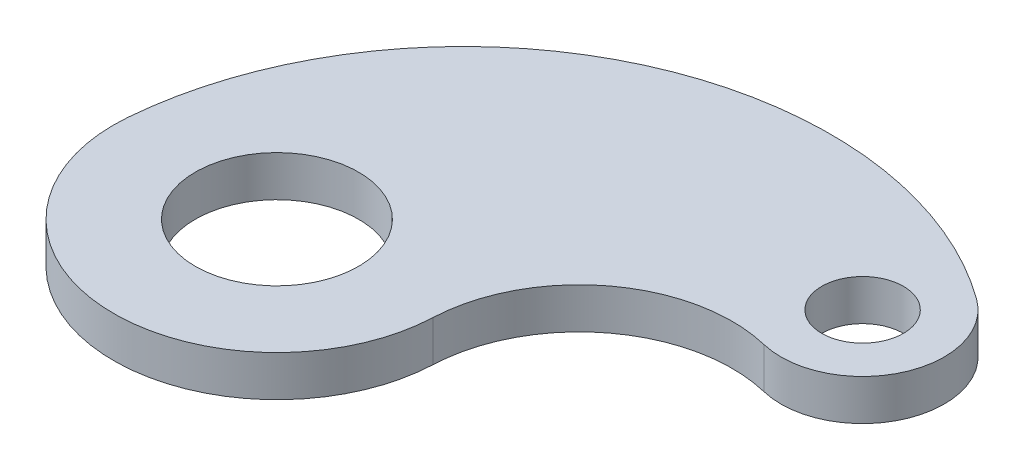
ISO-10303-21;
HEADER;
FILE_DESCRIPTION(('STEP AP214'),'2;1');
FILE_NAME('part.step','',(''),(''),'','','');
FILE_SCHEMA(('AUTOMOTIVE_DESIGN { 1 0 10303 214 1 1 1 1 }'));
ENDSEC;
DATA;
#1=APPLICATION_CONTEXT('core data for automotive mechanical design processes');
#2=APPLICATION_PROTOCOL_DEFINITION('international standard','automotive_design',2000,#1);
#3=PRODUCT_CONTEXT('',#1,'mechanical');
#4=PRODUCT('Part','Part','',(#3));
#5=PRODUCT_RELATED_PRODUCT_CATEGORY('part','',(#4));
#6=PRODUCT_DEFINITION_FORMATION('','',#4);
#7=PRODUCT_DEFINITION_CONTEXT('part definition',#1,'design');
#8=PRODUCT_DEFINITION('design','',#6,#7);
#9=PRODUCT_DEFINITION_SHAPE('','',#8);
#10=(LENGTH_UNIT() NAMED_UNIT(*) SI_UNIT(.MILLI.,.METRE.));
#11=(NAMED_UNIT(*) PLANE_ANGLE_UNIT() SI_UNIT($,.RADIAN.));
#12=(NAMED_UNIT(*) SI_UNIT($,.STERADIAN.) SOLID_ANGLE_UNIT());
#13=UNCERTAINTY_MEASURE_WITH_UNIT(LENGTH_MEASURE(1.E-05),#10,'distance_accuracy_value','');
#14=(GEOMETRIC_REPRESENTATION_CONTEXT(3) GLOBAL_UNCERTAINTY_ASSIGNED_CONTEXT((#13)) GLOBAL_UNIT_ASSIGNED_CONTEXT((#10,
#11,#12)) REPRESENTATION_CONTEXT('',''));
#15=CARTESIAN_POINT('',(0.,0.,0.));
#16=DIRECTION('',(0.,0.,1.));
#17=DIRECTION('',(1.,0.,0.));
#18=AXIS2_PLACEMENT_3D('',#15,#16,#17);
#19=CARTESIAN_POINT('',(154.851548457861,-10.,6.78217813115695));
#20=DIRECTION('',(0.,1.,0.));
#21=DIRECTION('',(0.,0.,1.));
#22=AXIS2_PLACEMENT_3D('',#19,#20,#21);
#23=CYLINDRICAL_SURFACE('',#22,75.);
#24=DIRECTION('',(0.,1.,0.));
#25=VECTOR('',#24,1.);
#26=CARTESIAN_POINT('',(172.469235199298,-10.,-66.1192423891634));
#27=LINE('',#26,#25);
#28=CARTESIAN_POINT('',(172.469235199298,-10.,-66.1192423891634));
#29=VERTEX_POINT('',#28);
#30=CARTESIAN_POINT('',(172.469235199298,10.,-66.1192423891634));
#31=VERTEX_POINT('',#30);
#32=EDGE_CURVE('E48',#29,#31,#27,.T.);
#33=ORIENTED_EDGE('',*,*,#32,.T.);
#34=CARTESIAN_POINT('',(154.851548457861,10.,6.78217813115695));
#35=DIRECTION('',(0.,-1.,0.));
#36=DIRECTION('',(0.,0.,-1.));
#37=AXIS2_PLACEMENT_3D('',#34,#35,#36);
#38=CIRCLE('',#37,75.);
#39=CARTESIAN_POINT('',(79.9233798492185,10.,3.5004790354358));
#40=VERTEX_POINT('',#39);
#41=EDGE_CURVE('E86',#40,#31,#38,.T.);
#42=ORIENTED_EDGE('',*,*,#41,.F.);
#43=DIRECTION('',(0.,1.,0.));
#44=VECTOR('',#43,1.);
#45=CARTESIAN_POINT('',(79.9233798492185,-10.,3.5004790354358));
#46=LINE('',#45,#44);
#47=CARTESIAN_POINT('',(79.9233798492185,-10.,3.5004790354358));
#48=VERTEX_POINT('',#47);
#49=EDGE_CURVE('E11',#48,#40,#46,.T.);
#50=ORIENTED_EDGE('',*,*,#49,.F.);
#51=CARTESIAN_POINT('',(154.851548457861,-10.,6.78217813115695));
#52=DIRECTION('',(0.,-1.,0.));
#53=DIRECTION('',(0.,0.,-1.));
#54=AXIS2_PLACEMENT_3D('',#51,#52,#53);
#55=CIRCLE('',#54,75.);
#56=EDGE_CURVE('E87',#48,#29,#55,.T.);
#57=ORIENTED_EDGE('',*,*,#56,.T.);
#58=EDGE_LOOP('',(#33,#42,#50,#57));
#59=FACE_BOUND('',#58,.T.);
#60=ADVANCED_FACE('F45',(#59),#23,.F.);
#61=CARTESIAN_POINT('',(0.,-10.,0.));
#62=DIRECTION('',(0.,1.,0.));
#63=DIRECTION('',(0.,0.,1.));
#64=AXIS2_PLACEMENT_3D('',#61,#62,#63);
#65=CYLINDRICAL_SURFACE('',#64,80.);
#66=ORIENTED_EDGE('',*,*,#49,.T.);
#67=CARTESIAN_POINT('',(0.,10.,0.));
#68=DIRECTION('',(0.,1.,0.));
#69=DIRECTION('',(0.,0.,1.));
#70=AXIS2_PLACEMENT_3D('',#67,#68,#69);
#71=CIRCLE('',#70,80.);
#72=CARTESIAN_POINT('',(-79.7226971382221,10.,-6.65519053125484));
#73=VERTEX_POINT('',#72);
#74=EDGE_CURVE('E106',#73,#40,#71,.T.);
#75=ORIENTED_EDGE('',*,*,#74,.F.);
#76=DIRECTION('',(0.,1.,0.));
#77=VECTOR('',#76,1.);
#78=CARTESIAN_POINT('',(-79.7226971382221,-10.,-6.65519053125484));
#79=LINE('',#78,#77);
#80=CARTESIAN_POINT('',(-79.7226971382221,-10.,-6.65519053125484));
#81=VERTEX_POINT('',#80);
#82=EDGE_CURVE('E54',#81,#73,#79,.T.);
#83=ORIENTED_EDGE('',*,*,#82,.F.);
#84=CARTESIAN_POINT('',(0.,-10.,0.));
#85=DIRECTION('',(0.,1.,0.));
#86=DIRECTION('',(0.,0.,1.));
#87=AXIS2_PLACEMENT_3D('',#84,#85,#86);
#88=CIRCLE('',#87,80.);
#89=EDGE_CURVE('E93',#81,#48,#88,.T.);
#90=ORIENTED_EDGE('',*,*,#89,.T.);
#91=EDGE_LOOP('',(#66,#75,#83,#90));
#92=FACE_BOUND('',#91,.T.);
#93=ADVANCED_FACE('F144',(#92),#65,.T.);
#94=CARTESIAN_POINT('',(99.6533714227777,-10.,8.31898816406854));
#95=DIRECTION('',(0.,1.,0.));
#96=DIRECTION('',(0.,0.,1.));
#97=AXIS2_PLACEMENT_3D('',#94,#95,#96);
#98=CYLINDRICAL_SURFACE('',#97,180.);
#99=ORIENTED_EDGE('',*,*,#82,.T.);
#100=CARTESIAN_POINT('',(99.6533714227777,10.,8.31898816406854));
#101=DIRECTION('',(0.,1.,0.));
#102=DIRECTION('',(0.,0.,-1.));
#103=AXIS2_PLACEMENT_3D('',#100,#101,#102);
#104=CIRCLE('',#103,180.);
#105=CARTESIAN_POINT('',(205.354467186718,10.,-137.376853761164));
#106=VERTEX_POINT('',#105);
#107=EDGE_CURVE('E101',#106,#73,#104,.T.);
#108=ORIENTED_EDGE('',*,*,#107,.F.);
#109=DIRECTION('',(0.,1.,0.));
#110=VECTOR('',#109,1.);
#111=CARTESIAN_POINT('',(205.354467186718,-10.,-137.376853761164));
#112=LINE('',#111,#110);
#113=CARTESIAN_POINT('',(205.354467186718,-10.,-137.376853761164));
#114=VERTEX_POINT('',#113);
#115=EDGE_CURVE('E92',#114,#106,#112,.T.);
#116=ORIENTED_EDGE('',*,*,#115,.F.);
#117=CARTESIAN_POINT('',(99.6533714227777,-10.,8.31898816406854));
#118=DIRECTION('',(0.,1.,0.));
#119=DIRECTION('',(0.,0.,-1.));
#120=AXIS2_PLACEMENT_3D('',#117,#118,#119);
#121=CIRCLE('',#120,180.);
#122=EDGE_CURVE('E133',#114,#81,#121,.T.);
#123=ORIENTED_EDGE('',*,*,#122,.T.);
#124=EDGE_LOOP('',(#99,#108,#116,#123));
#125=FACE_BOUND('',#124,.T.);
#126=ADVANCED_FACE('F141',(#125),#98,.T.);
#127=CARTESIAN_POINT('',(181.865334794732,-10.,-105.000000000001));
#128=DIRECTION('',(0.,1.,0.));
#129=DIRECTION('',(0.,0.,1.));
#130=AXIS2_PLACEMENT_3D('',#127,#128,#129);
#131=CYLINDRICAL_SURFACE('',#130,40.);
#132=ORIENTED_EDGE('',*,*,#115,.T.);
#133=CARTESIAN_POINT('',(181.865334794732,10.,-105.000000000001));
#134=DIRECTION('',(0.,1.,0.));
#135=DIRECTION('',(0.,0.,1.));
#136=AXIS2_PLACEMENT_3D('',#133,#134,#135);
#137=CIRCLE('',#136,40.);
#138=EDGE_CURVE('E95',#31,#106,#137,.T.);
#139=ORIENTED_EDGE('',*,*,#138,.F.);
#140=ORIENTED_EDGE('',*,*,#32,.F.);
#141=CARTESIAN_POINT('',(181.865334794732,-10.,-105.000000000001));
#142=DIRECTION('',(0.,1.,0.));
#143=DIRECTION('',(0.,0.,1.));
#144=AXIS2_PLACEMENT_3D('',#141,#142,#143);
#145=CIRCLE('',#144,40.);
#146=EDGE_CURVE('E130',#29,#114,#145,.T.);
#147=ORIENTED_EDGE('',*,*,#146,.T.);
#148=EDGE_LOOP('',(#132,#139,#140,#147));
#149=FACE_BOUND('',#148,.T.);
#150=ADVANCED_FACE('F96',(#149),#131,.T.);
#151=CARTESIAN_POINT('',(168.358441626296,-10.,-49.108910934422));
#152=DIRECTION('',(0.,-1.,0.));
#153=DIRECTION('',(0.,0.,-1.));
#154=AXIS2_PLACEMENT_3D('',#151,#152,#153);
#155=PLANE('',#154);
#156=CARTESIAN_POINT('',(181.865334794732,-10.,-105.000000000001));
#157=DIRECTION('',(0.,1.,0.));
#158=DIRECTION('',(0.,0.,1.));
#159=AXIS2_PLACEMENT_3D('',#156,#157,#158);
#160=CIRCLE('',#159,20.);
#161=CARTESIAN_POINT('',(181.865334794732,-10.,-85.000000000001));
#162=VERTEX_POINT('',#161);
#163=EDGE_CURVE('E120',#162,#162,#160,.T.);
#164=ORIENTED_EDGE('',*,*,#163,.T.);
#165=EDGE_LOOP('',(#164));
#166=FACE_BOUND('',#165,.T.);
#167=CARTESIAN_POINT('',(0.,-10.,0.));
#168=DIRECTION('',(0.,1.,0.));
#169=DIRECTION('',(0.,0.,1.));
#170=AXIS2_PLACEMENT_3D('',#167,#168,#169);
#171=CIRCLE('',#170,40.);
#172=CARTESIAN_POINT('',(0.,-10.,40.));
#173=VERTEX_POINT('',#172);
#174=EDGE_CURVE('E124',#173,#173,#171,.T.);
#175=ORIENTED_EDGE('',*,*,#174,.T.);
#176=EDGE_LOOP('',(#175));
#177=FACE_BOUND('',#176,.T.);
#178=ORIENTED_EDGE('',*,*,#56,.F.);
#179=ORIENTED_EDGE('',*,*,#89,.F.);
#180=ORIENTED_EDGE('',*,*,#122,.F.);
#181=ORIENTED_EDGE('',*,*,#146,.F.);
#182=EDGE_LOOP('',(#178,#179,#180,#181));
#183=FACE_BOUND('',#182,.T.);
#184=ADVANCED_FACE('F146',(#166,#177,#183),#155,.T.);
#185=CARTESIAN_POINT('',(0.,-10.,0.));
#186=DIRECTION('',(0.,1.,0.));
#187=DIRECTION('',(0.,0.,1.));
#188=AXIS2_PLACEMENT_3D('',#185,#186,#187);
#189=CYLINDRICAL_SURFACE('',#188,40.);
#190=ORIENTED_EDGE('',*,*,#174,.F.);
#191=EDGE_LOOP('',(#190));
#192=FACE_BOUND('',#191,.T.);
#193=CARTESIAN_POINT('',(0.,10.,0.));
#194=DIRECTION('',(0.,1.,0.));
#195=DIRECTION('',(0.,0.,1.));
#196=AXIS2_PLACEMENT_3D('',#193,#194,#195);
#197=CIRCLE('',#196,40.);
#198=CARTESIAN_POINT('',(0.,10.,40.));
#199=VERTEX_POINT('',#198);
#200=EDGE_CURVE('E108',#199,#199,#197,.T.);
#201=ORIENTED_EDGE('',*,*,#200,.T.);
#202=EDGE_LOOP('',(#201));
#203=FACE_BOUND('',#202,.T.);
#204=ADVANCED_FACE('F148',(#192,#203),#189,.F.);
#205=CARTESIAN_POINT('',(181.865334794732,-10.,-105.000000000001));
#206=DIRECTION('',(0.,1.,0.));
#207=DIRECTION('',(0.,0.,1.));
#208=AXIS2_PLACEMENT_3D('',#205,#206,#207);
#209=CYLINDRICAL_SURFACE('',#208,20.);
#210=ORIENTED_EDGE('',*,*,#163,.F.);
#211=EDGE_LOOP('',(#210));
#212=FACE_BOUND('',#211,.T.);
#213=CARTESIAN_POINT('',(181.865334794732,10.,-105.000000000001));
#214=DIRECTION('',(0.,1.,0.));
#215=DIRECTION('',(0.,0.,1.));
#216=AXIS2_PLACEMENT_3D('',#213,#214,#215);
#217=CIRCLE('',#216,20.);
#218=CARTESIAN_POINT('',(181.865334794732,10.,-85.000000000001));
#219=VERTEX_POINT('',#218);
#220=EDGE_CURVE('E112',#219,#219,#217,.T.);
#221=ORIENTED_EDGE('',*,*,#220,.T.);
#222=EDGE_LOOP('',(#221));
#223=FACE_BOUND('',#222,.T.);
#224=ADVANCED_FACE('F155',(#212,#223),#209,.F.);
#225=CARTESIAN_POINT('',(168.358441626296,10.,-49.108910934422));
#226=DIRECTION('',(0.,-1.,0.));
#227=DIRECTION('',(0.,0.,-1.));
#228=AXIS2_PLACEMENT_3D('',#225,#226,#227);
#229=PLANE('',#228);
#230=ORIENTED_EDGE('',*,*,#41,.T.);
#231=ORIENTED_EDGE('',*,*,#138,.T.);
#232=ORIENTED_EDGE('',*,*,#107,.T.);
#233=ORIENTED_EDGE('',*,*,#74,.T.);
#234=EDGE_LOOP('',(#230,#231,#232,#233));
#235=FACE_BOUND('',#234,.T.);
#236=ORIENTED_EDGE('',*,*,#200,.F.);
#237=EDGE_LOOP('',(#236));
#238=FACE_BOUND('',#237,.T.);
#239=ORIENTED_EDGE('',*,*,#220,.F.);
#240=EDGE_LOOP('',(#239));
#241=FACE_BOUND('',#240,.T.);
#242=ADVANCED_FACE('F104',(#235,#238,#241),#229,.F.);
#243=CLOSED_SHELL('',(#60,#93,#126,#150,#184,#204,#224,#242));
#244=MANIFOLD_SOLID_BREP('B2',#243);
#245=ADVANCED_BREP_SHAPE_REPRESENTATION('',(#18,#244),#14);
#246=SHAPE_DEFINITION_REPRESENTATION(#9,#245);
ENDSEC;
END-ISO-10303-21;
